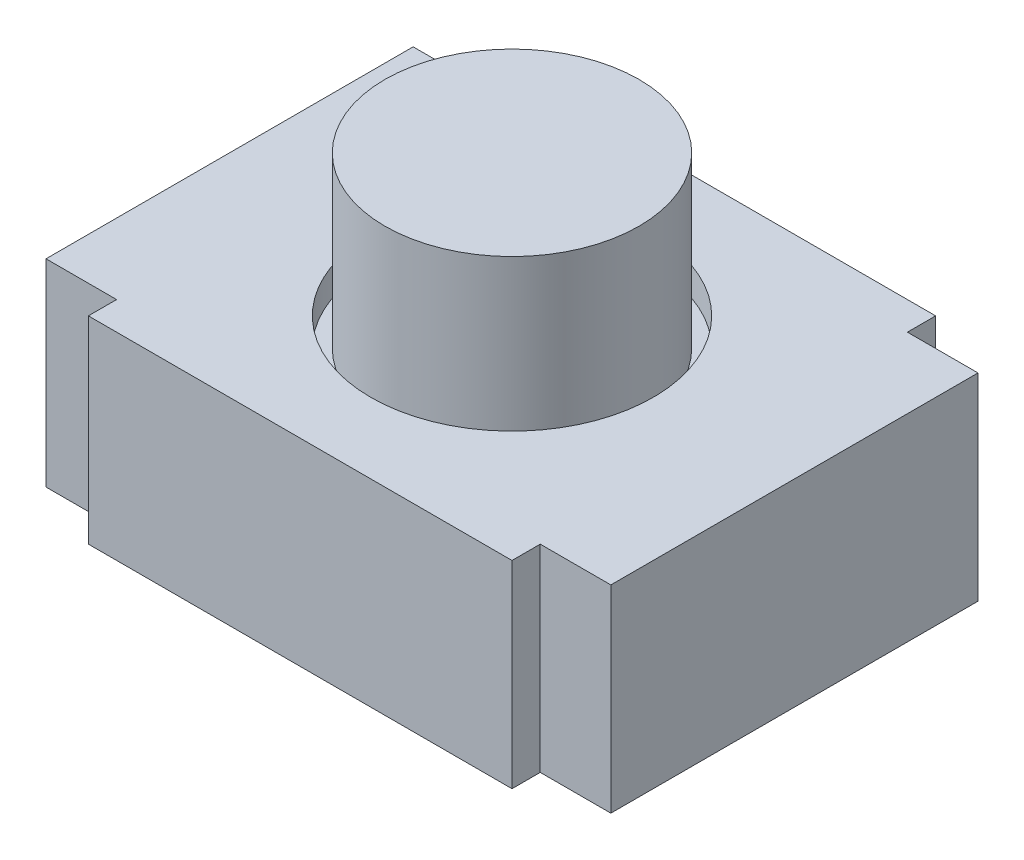
ISO-10303-21;
HEADER;
FILE_DESCRIPTION(('STEP AP214'),'2;1');
FILE_NAME('part.step','',(''),(''),'','','');
FILE_SCHEMA(('AUTOMOTIVE_DESIGN { 1 0 10303 214 1 1 1 1 }'));
ENDSEC;
DATA;
#1=APPLICATION_CONTEXT('core data for automotive mechanical design processes');
#2=APPLICATION_PROTOCOL_DEFINITION('international standard','automotive_design',2000,#1);
#3=PRODUCT_CONTEXT('',#1,'mechanical');
#4=PRODUCT('Part','Part','',(#3));
#5=PRODUCT_RELATED_PRODUCT_CATEGORY('part','',(#4));
#6=PRODUCT_DEFINITION_FORMATION('','',#4);
#7=PRODUCT_DEFINITION_CONTEXT('part definition',#1,'design');
#8=PRODUCT_DEFINITION('design','',#6,#7);
#9=PRODUCT_DEFINITION_SHAPE('','',#8);
#10=(LENGTH_UNIT() NAMED_UNIT(*) SI_UNIT(.MILLI.,.METRE.));
#11=(NAMED_UNIT(*) PLANE_ANGLE_UNIT() SI_UNIT($,.RADIAN.));
#12=(NAMED_UNIT(*) SI_UNIT($,.STERADIAN.) SOLID_ANGLE_UNIT());
#13=UNCERTAINTY_MEASURE_WITH_UNIT(LENGTH_MEASURE(1.E-05),#10,'distance_accuracy_value','');
#14=(GEOMETRIC_REPRESENTATION_CONTEXT(3) GLOBAL_UNCERTAINTY_ASSIGNED_CONTEXT((#13)) GLOBAL_UNIT_ASSIGNED_CONTEXT((#10,
#11,#12)) REPRESENTATION_CONTEXT('',''));
#15=CARTESIAN_POINT('',(0.,0.,0.));
#16=DIRECTION('',(0.,0.,1.));
#17=DIRECTION('',(1.,0.,0.));
#18=AXIS2_PLACEMENT_3D('',#15,#16,#17);
#19=CARTESIAN_POINT('',(0.,0.,0.));
#20=DIRECTION('',(0.,1.,0.));
#21=DIRECTION('',(0.,0.,1.));
#22=AXIS2_PLACEMENT_3D('',#19,#20,#21);
#23=PLANE('',#22);
#24=CARTESIAN_POINT('',(0.,0.,0.));
#25=DIRECTION('',(0.,1.,0.));
#26=DIRECTION('',(0.,0.,1.));
#27=AXIS2_PLACEMENT_3D('',#24,#25,#26);
#28=CIRCLE('',#27,0.9);
#29=CARTESIAN_POINT('',(0.,0.,0.9));
#30=VERTEX_POINT('',#29);
#31=EDGE_CURVE('E11',#30,#30,#28,.T.);
#32=ORIENTED_EDGE('',*,*,#31,.F.);
#33=EDGE_LOOP('',(#32));
#34=FACE_BOUND('',#33,.T.);
#35=CARTESIAN_POINT('',(0.,0.,0.));
#36=DIRECTION('',(0.,1.,0.));
#37=DIRECTION('',(0.,0.,1.));
#38=AXIS2_PLACEMENT_3D('',#35,#36,#37);
#39=CIRCLE('',#38,1.);
#40=CARTESIAN_POINT('',(0.,0.,1.));
#41=VERTEX_POINT('',#40);
#42=EDGE_CURVE('E151',#41,#41,#39,.F.);
#43=ORIENTED_EDGE('',*,*,#42,.F.);
#44=EDGE_LOOP('',(#43));
#45=FACE_BOUND('',#44,.T.);
#46=ADVANCED_FACE('F32',(#34,#45),#23,.T.);
#47=CARTESIAN_POINT('',(0.,4.74558441227157,0.));
#48=DIRECTION('',(0.,-1.,0.));
#49=DIRECTION('',(0.,0.,-1.));
#50=AXIS2_PLACEMENT_3D('',#47,#48,#49);
#51=CYLINDRICAL_SURFACE('',#50,0.9);
#52=ORIENTED_EDGE('',*,*,#31,.T.);
#53=EDGE_LOOP('',(#52));
#54=FACE_BOUND('',#53,.T.);
#55=CARTESIAN_POINT('',(0.,1.2,0.));
#56=DIRECTION('',(0.,1.,0.));
#57=DIRECTION('',(0.,0.,1.));
#58=AXIS2_PLACEMENT_3D('',#55,#56,#57);
#59=CIRCLE('',#58,0.9);
#60=CARTESIAN_POINT('',(0.,1.2,0.9));
#61=VERTEX_POINT('',#60);
#62=EDGE_CURVE('E200',#61,#61,#59,.T.);
#63=ORIENTED_EDGE('',*,*,#62,.F.);
#64=EDGE_LOOP('',(#63));
#65=FACE_BOUND('',#64,.T.);
#66=ADVANCED_FACE('F243',(#54,#65),#51,.T.);
#67=CARTESIAN_POINT('',(0.,1.2,0.));
#68=DIRECTION('',(0.,1.,0.));
#69=DIRECTION('',(0.,0.,1.));
#70=AXIS2_PLACEMENT_3D('',#67,#68,#69);
#71=PLANE('',#70);
#72=ORIENTED_EDGE('',*,*,#62,.T.);
#73=EDGE_LOOP('',(#72));
#74=FACE_BOUND('',#73,.T.);
#75=ADVANCED_FACE('F249',(#74),#71,.T.);
#76=CARTESIAN_POINT('',(1.5,0.2,1.3));
#77=DIRECTION('',(-1.,0.,0.));
#78=DIRECTION('',(0.,0.,1.));
#79=AXIS2_PLACEMENT_3D('',#76,#77,#78);
#80=PLANE('',#79);
#81=DIRECTION('',(0.,-1.,0.));
#82=VECTOR('',#81,1.);
#83=CARTESIAN_POINT('',(1.5,0.2,1.5));
#84=LINE('',#83,#82);
#85=CARTESIAN_POINT('',(1.5,0.2,1.5));
#86=VERTEX_POINT('',#85);
#87=CARTESIAN_POINT('',(1.5,-1.2,1.5));
#88=VERTEX_POINT('',#87);
#89=EDGE_CURVE('E194',#86,#88,#84,.T.);
#90=ORIENTED_EDGE('',*,*,#89,.T.);
#91=DIRECTION('',(0.,0.,-1.));
#92=VECTOR('',#91,1.);
#93=CARTESIAN_POINT('',(1.5,-1.2,1.5));
#94=LINE('',#93,#92);
#95=CARTESIAN_POINT('',(1.5,-1.2,1.3));
#96=VERTEX_POINT('',#95);
#97=EDGE_CURVE('E155',#88,#96,#94,.T.);
#98=ORIENTED_EDGE('',*,*,#97,.T.);
#99=DIRECTION('',(0.,1.,0.));
#100=VECTOR('',#99,1.);
#101=CARTESIAN_POINT('',(1.5,-4.20665927567458,1.3));
#102=LINE('',#101,#100);
#103=CARTESIAN_POINT('',(1.5,0.2,1.3));
#104=VERTEX_POINT('',#103);
#105=EDGE_CURVE('E163',#96,#104,#102,.T.);
#106=ORIENTED_EDGE('',*,*,#105,.T.);
#107=DIRECTION('',(0.,0.,-1.));
#108=VECTOR('',#107,1.);
#109=CARTESIAN_POINT('',(1.5,0.2,1.3));
#110=LINE('',#109,#108);
#111=EDGE_CURVE('E162',#86,#104,#110,.T.);
#112=ORIENTED_EDGE('',*,*,#111,.F.);
#113=EDGE_LOOP('',(#90,#98,#106,#112));
#114=FACE_BOUND('',#113,.T.);
#115=ADVANCED_FACE('F288',(#114),#80,.F.);
#116=CARTESIAN_POINT('',(1.5,0.2,-1.5));
#117=DIRECTION('',(-1.,0.,0.));
#118=DIRECTION('',(0.,0.,1.));
#119=AXIS2_PLACEMENT_3D('',#116,#117,#118);
#120=PLANE('',#119);
#121=DIRECTION('',(0.,-1.,0.));
#122=VECTOR('',#121,1.);
#123=CARTESIAN_POINT('',(1.5,0.2,-1.3));
#124=LINE('',#123,#122);
#125=CARTESIAN_POINT('',(1.5,0.2,-1.3));
#126=VERTEX_POINT('',#125);
#127=CARTESIAN_POINT('',(1.5,-1.2,-1.3));
#128=VERTEX_POINT('',#127);
#129=EDGE_CURVE('E57',#126,#128,#124,.T.);
#130=ORIENTED_EDGE('',*,*,#129,.T.);
#131=DIRECTION('',(0.,0.,-1.));
#132=VECTOR('',#131,1.);
#133=CARTESIAN_POINT('',(1.5,-1.2,-1.5));
#134=LINE('',#133,#132);
#135=CARTESIAN_POINT('',(1.5,-1.2,-1.5));
#136=VERTEX_POINT('',#135);
#137=EDGE_CURVE('E146',#128,#136,#134,.T.);
#138=ORIENTED_EDGE('',*,*,#137,.T.);
#139=DIRECTION('',(0.,-1.,0.));
#140=VECTOR('',#139,1.);
#141=CARTESIAN_POINT('',(1.5,0.2,-1.5));
#142=LINE('',#141,#140);
#143=CARTESIAN_POINT('',(1.5,0.2,-1.5));
#144=VERTEX_POINT('',#143);
#145=EDGE_CURVE('E135',#144,#136,#142,.T.);
#146=ORIENTED_EDGE('',*,*,#145,.F.);
#147=DIRECTION('',(0.,0.,-1.));
#148=VECTOR('',#147,1.);
#149=CARTESIAN_POINT('',(1.5,0.2,-1.5));
#150=LINE('',#149,#148);
#151=EDGE_CURVE('E177',#126,#144,#150,.T.);
#152=ORIENTED_EDGE('',*,*,#151,.F.);
#153=EDGE_LOOP('',(#130,#138,#146,#152));
#154=FACE_BOUND('',#153,.T.);
#155=ADVANCED_FACE('F230',(#154),#120,.F.);
#156=CARTESIAN_POINT('',(-1.5,0.2,-1.5));
#157=DIRECTION('',(0.,0.,1.));
#158=DIRECTION('',(1.,0.,0.));
#159=AXIS2_PLACEMENT_3D('',#156,#157,#158);
#160=PLANE('',#159);
#161=ORIENTED_EDGE('',*,*,#145,.T.);
#162=DIRECTION('',(-1.,0.,0.));
#163=VECTOR('',#162,1.);
#164=CARTESIAN_POINT('',(1.5,-1.2,-1.5));
#165=LINE('',#164,#163);
#166=CARTESIAN_POINT('',(-1.5,-1.2,-1.5));
#167=VERTEX_POINT('',#166);
#168=EDGE_CURVE('E143',#136,#167,#165,.T.);
#169=ORIENTED_EDGE('',*,*,#168,.T.);
#170=DIRECTION('',(0.,-1.,0.));
#171=VECTOR('',#170,1.);
#172=CARTESIAN_POINT('',(-1.5,0.2,-1.5));
#173=LINE('',#172,#171);
#174=CARTESIAN_POINT('',(-1.5,0.2,-1.5));
#175=VERTEX_POINT('',#174);
#176=EDGE_CURVE('E126',#175,#167,#173,.T.);
#177=ORIENTED_EDGE('',*,*,#176,.F.);
#178=DIRECTION('',(-1.,0.,0.));
#179=VECTOR('',#178,1.);
#180=CARTESIAN_POINT('',(-1.5,0.2,-1.5));
#181=LINE('',#180,#179);
#182=EDGE_CURVE('E179',#144,#175,#181,.T.);
#183=ORIENTED_EDGE('',*,*,#182,.F.);
#184=EDGE_LOOP('',(#161,#169,#177,#183));
#185=FACE_BOUND('',#184,.T.);
#186=ADVANCED_FACE('F148',(#185),#160,.F.);
#187=CARTESIAN_POINT('',(-1.5,0.2,-1.5));
#188=DIRECTION('',(1.,0.,0.));
#189=DIRECTION('',(0.,0.,-1.));
#190=AXIS2_PLACEMENT_3D('',#187,#188,#189);
#191=PLANE('',#190);
#192=ORIENTED_EDGE('',*,*,#176,.T.);
#193=DIRECTION('',(0.,0.,1.));
#194=VECTOR('',#193,1.);
#195=CARTESIAN_POINT('',(-1.5,-1.2,-1.5));
#196=LINE('',#195,#194);
#197=CARTESIAN_POINT('',(-1.5,-1.2,-1.3));
#198=VERTEX_POINT('',#197);
#199=EDGE_CURVE('E129',#167,#198,#196,.T.);
#200=ORIENTED_EDGE('',*,*,#199,.T.);
#201=DIRECTION('',(0.,1.,0.));
#202=VECTOR('',#201,1.);
#203=CARTESIAN_POINT('',(-1.5,-4.20665927567458,-1.3));
#204=LINE('',#203,#202);
#205=CARTESIAN_POINT('',(-1.5,0.2,-1.3));
#206=VERTEX_POINT('',#205);
#207=EDGE_CURVE('E49',#198,#206,#204,.T.);
#208=ORIENTED_EDGE('',*,*,#207,.T.);
#209=DIRECTION('',(0.,0.,1.));
#210=VECTOR('',#209,1.);
#211=CARTESIAN_POINT('',(-1.5,0.2,-1.5));
#212=LINE('',#211,#210);
#213=EDGE_CURVE('E131',#175,#206,#212,.T.);
#214=ORIENTED_EDGE('',*,*,#213,.F.);
#215=EDGE_LOOP('',(#192,#200,#208,#214));
#216=FACE_BOUND('',#215,.T.);
#217=ADVANCED_FACE('F128',(#216),#191,.F.);
#218=CARTESIAN_POINT('',(-1.5,0.2,1.3));
#219=DIRECTION('',(1.,0.,0.));
#220=DIRECTION('',(0.,0.,-1.));
#221=AXIS2_PLACEMENT_3D('',#218,#219,#220);
#222=PLANE('',#221);
#223=DIRECTION('',(0.,-1.,0.));
#224=VECTOR('',#223,1.);
#225=CARTESIAN_POINT('',(-1.5,0.2,1.3));
#226=LINE('',#225,#224);
#227=CARTESIAN_POINT('',(-1.5,0.2,1.3));
#228=VERTEX_POINT('',#227);
#229=CARTESIAN_POINT('',(-1.5,-1.2,1.3));
#230=VERTEX_POINT('',#229);
#231=EDGE_CURVE('E136',#228,#230,#226,.T.);
#232=ORIENTED_EDGE('',*,*,#231,.T.);
#233=DIRECTION('',(0.,0.,1.));
#234=VECTOR('',#233,1.);
#235=CARTESIAN_POINT('',(-1.5,-1.2,1.5));
#236=LINE('',#235,#234);
#237=CARTESIAN_POINT('',(-1.5,-1.2,1.5));
#238=VERTEX_POINT('',#237);
#239=EDGE_CURVE('E158',#230,#238,#236,.T.);
#240=ORIENTED_EDGE('',*,*,#239,.T.);
#241=DIRECTION('',(0.,-1.,0.));
#242=VECTOR('',#241,1.);
#243=CARTESIAN_POINT('',(-1.5,0.2,1.5));
#244=LINE('',#243,#242);
#245=CARTESIAN_POINT('',(-1.5,0.2,1.5));
#246=VERTEX_POINT('',#245);
#247=EDGE_CURVE('E196',#246,#238,#244,.T.);
#248=ORIENTED_EDGE('',*,*,#247,.F.);
#249=DIRECTION('',(0.,0.,1.));
#250=VECTOR('',#249,1.);
#251=CARTESIAN_POINT('',(-1.5,0.2,1.3));
#252=LINE('',#251,#250);
#253=EDGE_CURVE('E190',#228,#246,#252,.T.);
#254=ORIENTED_EDGE('',*,*,#253,.F.);
#255=EDGE_LOOP('',(#232,#240,#248,#254));
#256=FACE_BOUND('',#255,.T.);
#257=ADVANCED_FACE('F281',(#256),#222,.F.);
#258=CARTESIAN_POINT('',(-1.5,0.2,1.5));
#259=DIRECTION('',(0.,0.,-1.));
#260=DIRECTION('',(-1.,0.,0.));
#261=AXIS2_PLACEMENT_3D('',#258,#259,#260);
#262=PLANE('',#261);
#263=ORIENTED_EDGE('',*,*,#247,.T.);
#264=DIRECTION('',(1.,0.,0.));
#265=VECTOR('',#264,1.);
#266=CARTESIAN_POINT('',(-1.5,-1.2,1.5));
#267=LINE('',#266,#265);
#268=EDGE_CURVE('E159',#238,#88,#267,.T.);
#269=ORIENTED_EDGE('',*,*,#268,.T.);
#270=ORIENTED_EDGE('',*,*,#89,.F.);
#271=DIRECTION('',(1.,0.,0.));
#272=VECTOR('',#271,1.);
#273=CARTESIAN_POINT('',(-1.5,0.2,1.5));
#274=LINE('',#273,#272);
#275=EDGE_CURVE('E192',#246,#86,#274,.T.);
#276=ORIENTED_EDGE('',*,*,#275,.F.);
#277=EDGE_LOOP('',(#263,#269,#270,#276));
#278=FACE_BOUND('',#277,.T.);
#279=ADVANCED_FACE('F286',(#278),#262,.F.);
#280=CARTESIAN_POINT('',(0.,0.2,0.));
#281=DIRECTION('',(0.,1.,0.));
#282=DIRECTION('',(0.,0.,1.));
#283=AXIS2_PLACEMENT_3D('',#280,#281,#282);
#284=PLANE('',#283);
#285=CARTESIAN_POINT('',(0.,0.2,0.));
#286=DIRECTION('',(0.,1.,0.));
#287=DIRECTION('',(0.,0.,1.));
#288=AXIS2_PLACEMENT_3D('',#285,#286,#287);
#289=CIRCLE('',#288,1.);
#290=CARTESIAN_POINT('',(0.,0.2,1.));
#291=VERTEX_POINT('',#290);
#292=EDGE_CURVE('E293',#291,#291,#289,.T.);
#293=ORIENTED_EDGE('',*,*,#292,.F.);
#294=EDGE_LOOP('',(#293));
#295=FACE_BOUND('',#294,.T.);
#296=ORIENTED_EDGE('',*,*,#111,.T.);
#297=DIRECTION('',(1.,0.,0.));
#298=VECTOR('',#297,1.);
#299=CARTESIAN_POINT('',(2.,0.2,1.3));
#300=LINE('',#299,#298);
#301=CARTESIAN_POINT('',(2.,0.2,1.3));
#302=VERTEX_POINT('',#301);
#303=EDGE_CURVE('E169',#104,#302,#300,.T.);
#304=ORIENTED_EDGE('',*,*,#303,.T.);
#305=DIRECTION('',(0.,0.,-1.));
#306=VECTOR('',#305,1.);
#307=CARTESIAN_POINT('',(2.,0.2,-1.3));
#308=LINE('',#307,#306);
#309=CARTESIAN_POINT('',(2.,0.2,-1.3));
#310=VERTEX_POINT('',#309);
#311=EDGE_CURVE('E172',#302,#310,#308,.T.);
#312=ORIENTED_EDGE('',*,*,#311,.T.);
#313=DIRECTION('',(-1.,0.,0.));
#314=VECTOR('',#313,1.);
#315=CARTESIAN_POINT('',(1.5,0.2,-1.3));
#316=LINE('',#315,#314);
#317=EDGE_CURVE('E175',#310,#126,#316,.T.);
#318=ORIENTED_EDGE('',*,*,#317,.T.);
#319=ORIENTED_EDGE('',*,*,#151,.T.);
#320=ORIENTED_EDGE('',*,*,#182,.T.);
#321=ORIENTED_EDGE('',*,*,#213,.T.);
#322=DIRECTION('',(-1.,0.,0.));
#323=VECTOR('',#322,1.);
#324=CARTESIAN_POINT('',(-1.5,0.2,-1.3));
#325=LINE('',#324,#323);
#326=CARTESIAN_POINT('',(-2.,0.2,-1.3));
#327=VERTEX_POINT('',#326);
#328=EDGE_CURVE('E182',#206,#327,#325,.T.);
#329=ORIENTED_EDGE('',*,*,#328,.T.);
#330=DIRECTION('',(0.,0.,1.));
#331=VECTOR('',#330,1.);
#332=CARTESIAN_POINT('',(-2.,0.2,-1.3));
#333=LINE('',#332,#331);
#334=CARTESIAN_POINT('',(-2.,0.2,1.3));
#335=VERTEX_POINT('',#334);
#336=EDGE_CURVE('E185',#327,#335,#333,.T.);
#337=ORIENTED_EDGE('',*,*,#336,.T.);
#338=DIRECTION('',(1.,0.,0.));
#339=VECTOR('',#338,1.);
#340=CARTESIAN_POINT('',(-2.,0.2,1.3));
#341=LINE('',#340,#339);
#342=EDGE_CURVE('E188',#335,#228,#341,.T.);
#343=ORIENTED_EDGE('',*,*,#342,.T.);
#344=ORIENTED_EDGE('',*,*,#253,.T.);
#345=ORIENTED_EDGE('',*,*,#275,.T.);
#346=EDGE_LOOP('',(#296,#304,#312,#318,#319,#320,#321,#329,#337,#343,#344,#345));
#347=FACE_BOUND('',#346,.T.);
#348=ADVANCED_FACE('F227',(#295,#347),#284,.T.);
#349=CARTESIAN_POINT('',(0.,-1.201,0.));
#350=DIRECTION('',(0.,1.,0.));
#351=DIRECTION('',(0.,0.,1.));
#352=AXIS2_PLACEMENT_3D('',#349,#350,#351);
#353=CYLINDRICAL_SURFACE('',#352,1.);
#354=ORIENTED_EDGE('',*,*,#292,.T.);
#355=EDGE_LOOP('',(#354));
#356=FACE_BOUND('',#355,.T.);
#357=ORIENTED_EDGE('',*,*,#42,.T.);
#358=EDGE_LOOP('',(#357));
#359=FACE_BOUND('',#358,.T.);
#360=ADVANCED_FACE('F265',(#356,#359),#353,.F.);
#361=CARTESIAN_POINT('',(-2.,-1.2,1.3));
#362=DIRECTION('',(0.,0.,1.));
#363=DIRECTION('',(1.,0.,0.));
#364=AXIS2_PLACEMENT_3D('',#361,#362,#363);
#365=PLANE('',#364);
#366=DIRECTION('',(1.,0.,0.));
#367=VECTOR('',#366,1.);
#368=CARTESIAN_POINT('',(-2.,-1.2,1.3));
#369=LINE('',#368,#367);
#370=CARTESIAN_POINT('',(-2.,-1.2,1.3));
#371=VERTEX_POINT('',#370);
#372=EDGE_CURVE('E213',#371,#230,#369,.T.);
#373=ORIENTED_EDGE('',*,*,#372,.T.);
#374=ORIENTED_EDGE('',*,*,#231,.F.);
#375=ORIENTED_EDGE('',*,*,#342,.F.);
#376=DIRECTION('',(0.,1.,0.));
#377=VECTOR('',#376,1.);
#378=CARTESIAN_POINT('',(-2.,-1.2,1.3));
#379=LINE('',#378,#377);
#380=EDGE_CURVE('E217',#371,#335,#379,.T.);
#381=ORIENTED_EDGE('',*,*,#380,.F.);
#382=EDGE_LOOP('',(#373,#374,#375,#381));
#383=FACE_BOUND('',#382,.T.);
#384=ADVANCED_FACE('F239',(#383),#365,.T.);
#385=CARTESIAN_POINT('',(-2.,-1.2,-1.3));
#386=DIRECTION('',(-1.,0.,0.));
#387=DIRECTION('',(0.,0.,1.));
#388=AXIS2_PLACEMENT_3D('',#385,#386,#387);
#389=PLANE('',#388);
#390=ORIENTED_EDGE('',*,*,#380,.T.);
#391=ORIENTED_EDGE('',*,*,#336,.F.);
#392=DIRECTION('',(0.,1.,0.));
#393=VECTOR('',#392,1.);
#394=CARTESIAN_POINT('',(-2.,-1.2,-1.3));
#395=LINE('',#394,#393);
#396=CARTESIAN_POINT('',(-2.,-1.2,-1.3));
#397=VERTEX_POINT('',#396);
#398=EDGE_CURVE('E218',#397,#327,#395,.T.);
#399=ORIENTED_EDGE('',*,*,#398,.F.);
#400=DIRECTION('',(0.,0.,1.));
#401=VECTOR('',#400,1.);
#402=CARTESIAN_POINT('',(-2.,-1.2,-1.3));
#403=LINE('',#402,#401);
#404=EDGE_CURVE('E209',#397,#371,#403,.T.);
#405=ORIENTED_EDGE('',*,*,#404,.T.);
#406=EDGE_LOOP('',(#390,#391,#399,#405));
#407=FACE_BOUND('',#406,.T.);
#408=ADVANCED_FACE('F234',(#407),#389,.T.);
#409=CARTESIAN_POINT('',(-2.,-1.2,-1.3));
#410=DIRECTION('',(0.,0.,-1.));
#411=DIRECTION('',(-1.,0.,0.));
#412=AXIS2_PLACEMENT_3D('',#409,#410,#411);
#413=PLANE('',#412);
#414=ORIENTED_EDGE('',*,*,#398,.T.);
#415=ORIENTED_EDGE('',*,*,#328,.F.);
#416=ORIENTED_EDGE('',*,*,#207,.F.);
#417=DIRECTION('',(-1.,0.,0.));
#418=VECTOR('',#417,1.);
#419=CARTESIAN_POINT('',(-2.,-1.2,-1.3));
#420=LINE('',#419,#418);
#421=EDGE_CURVE('E145',#198,#397,#420,.T.);
#422=ORIENTED_EDGE('',*,*,#421,.T.);
#423=EDGE_LOOP('',(#414,#415,#416,#422));
#424=FACE_BOUND('',#423,.T.);
#425=ADVANCED_FACE('F232',(#424),#413,.T.);
#426=CARTESIAN_POINT('',(2.,-1.2,-1.3));
#427=VERTEX_POINT('',#426);
#428=EDGE_CURVE('E207',#427,#128,#420,.T.);
#429=ORIENTED_EDGE('',*,*,#428,.T.);
#430=ORIENTED_EDGE('',*,*,#129,.F.);
#431=ORIENTED_EDGE('',*,*,#317,.F.);
#432=DIRECTION('',(0.,1.,0.));
#433=VECTOR('',#432,1.);
#434=CARTESIAN_POINT('',(2.,-1.2,-1.3));
#435=LINE('',#434,#433);
#436=EDGE_CURVE('E36',#427,#310,#435,.T.);
#437=ORIENTED_EDGE('',*,*,#436,.F.);
#438=EDGE_LOOP('',(#429,#430,#431,#437));
#439=FACE_BOUND('',#438,.T.);
#440=ADVANCED_FACE('F229',(#439),#413,.T.);
#441=CARTESIAN_POINT('',(2.,-1.2,-1.3));
#442=DIRECTION('',(1.,0.,0.));
#443=DIRECTION('',(0.,0.,-1.));
#444=AXIS2_PLACEMENT_3D('',#441,#442,#443);
#445=PLANE('',#444);
#446=ORIENTED_EDGE('',*,*,#436,.T.);
#447=ORIENTED_EDGE('',*,*,#311,.F.);
#448=DIRECTION('',(0.,1.,0.));
#449=VECTOR('',#448,1.);
#450=CARTESIAN_POINT('',(2.,-1.2,1.3));
#451=LINE('',#450,#449);
#452=CARTESIAN_POINT('',(2.,-1.2,1.3));
#453=VERTEX_POINT('',#452);
#454=EDGE_CURVE('E41',#453,#302,#451,.T.);
#455=ORIENTED_EDGE('',*,*,#454,.F.);
#456=DIRECTION('',(0.,0.,-1.));
#457=VECTOR('',#456,1.);
#458=CARTESIAN_POINT('',(2.,-1.2,-1.3));
#459=LINE('',#458,#457);
#460=EDGE_CURVE('E204',#453,#427,#459,.T.);
#461=ORIENTED_EDGE('',*,*,#460,.T.);
#462=EDGE_LOOP('',(#446,#447,#455,#461));
#463=FACE_BOUND('',#462,.T.);
#464=ADVANCED_FACE('F34',(#463),#445,.T.);
#465=ORIENTED_EDGE('',*,*,#454,.T.);
#466=ORIENTED_EDGE('',*,*,#303,.F.);
#467=ORIENTED_EDGE('',*,*,#105,.F.);
#468=EDGE_CURVE('E212',#96,#453,#369,.T.);
#469=ORIENTED_EDGE('',*,*,#468,.T.);
#470=EDGE_LOOP('',(#465,#466,#467,#469));
#471=FACE_BOUND('',#470,.T.);
#472=ADVANCED_FACE('F257',(#471),#365,.T.);
#473=CARTESIAN_POINT('',(0.,-1.2,0.));
#474=DIRECTION('',(0.,1.,0.));
#475=DIRECTION('',(0.,0.,1.));
#476=AXIS2_PLACEMENT_3D('',#473,#474,#475);
#477=PLANE('',#476);
#478=ORIENTED_EDGE('',*,*,#460,.F.);
#479=ORIENTED_EDGE('',*,*,#468,.F.);
#480=ORIENTED_EDGE('',*,*,#97,.F.);
#481=ORIENTED_EDGE('',*,*,#268,.F.);
#482=ORIENTED_EDGE('',*,*,#239,.F.);
#483=ORIENTED_EDGE('',*,*,#372,.F.);
#484=ORIENTED_EDGE('',*,*,#404,.F.);
#485=ORIENTED_EDGE('',*,*,#421,.F.);
#486=ORIENTED_EDGE('',*,*,#199,.F.);
#487=ORIENTED_EDGE('',*,*,#168,.F.);
#488=ORIENTED_EDGE('',*,*,#137,.F.);
#489=ORIENTED_EDGE('',*,*,#428,.F.);
#490=EDGE_LOOP('',(#478,#479,#480,#481,#482,#483,#484,#485,#486,#487,#488,#489));
#491=FACE_BOUND('',#490,.T.);
#492=ADVANCED_FACE('F141',(#491),#477,.F.);
#493=CLOSED_SHELL('',(#46,#66,#75,#115,#155,#186,#217,#257,#279,#348,#360,#384,#408,#425,#440,
#464,#472,#492));
#494=MANIFOLD_SOLID_BREP('B2',#493);
#495=ADVANCED_BREP_SHAPE_REPRESENTATION('',(#18,#494),#14);
#496=SHAPE_DEFINITION_REPRESENTATION(#9,#495);
ENDSEC;
END-ISO-10303-21;
